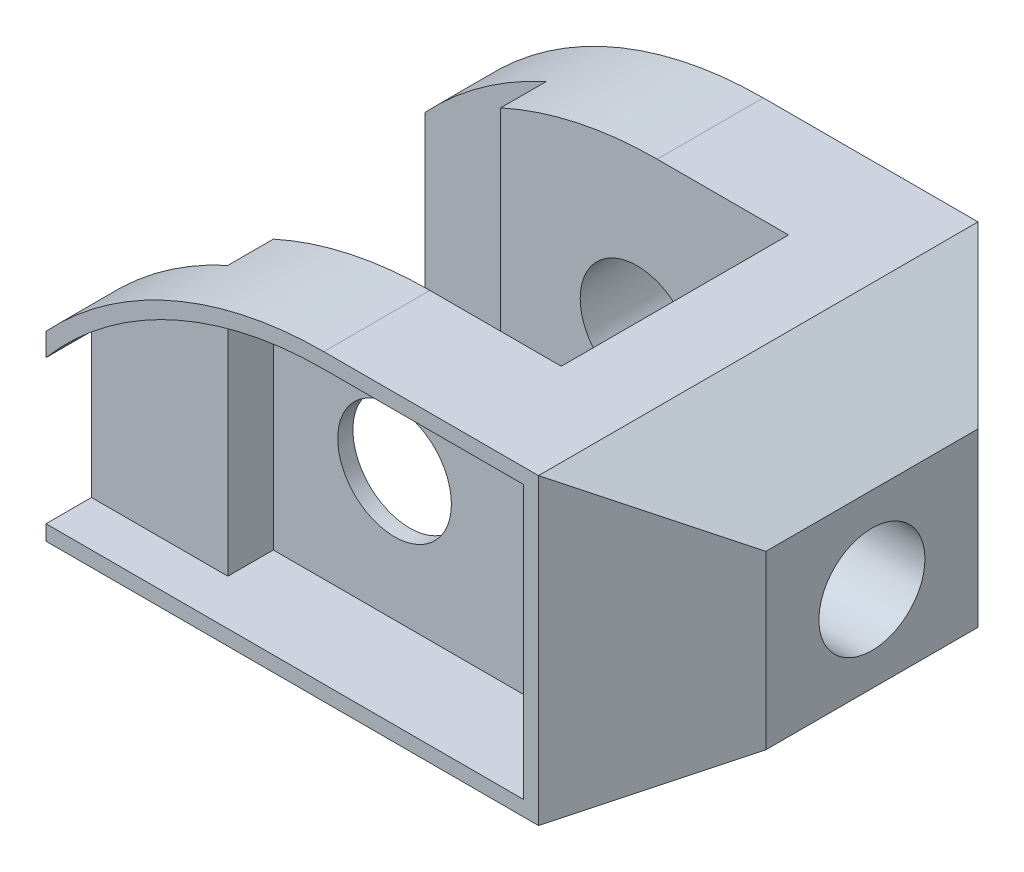
ISO-10303-21;
HEADER;
FILE_DESCRIPTION(('STEP AP214'),'2;1');
FILE_NAME('part.step','',(''),(''),'','','');
FILE_SCHEMA(('AUTOMOTIVE_DESIGN { 1 0 10303 214 1 1 1 1 }'));
ENDSEC;
DATA;
#1=APPLICATION_CONTEXT('core data for automotive mechanical design processes');
#2=APPLICATION_PROTOCOL_DEFINITION('international standard','automotive_design',2000,#1);
#3=PRODUCT_CONTEXT('',#1,'mechanical');
#4=PRODUCT('Part','Part','',(#3));
#5=PRODUCT_RELATED_PRODUCT_CATEGORY('part','',(#4));
#6=PRODUCT_DEFINITION_FORMATION('','',#4);
#7=PRODUCT_DEFINITION_CONTEXT('part definition',#1,'design');
#8=PRODUCT_DEFINITION('design','',#6,#7);
#9=PRODUCT_DEFINITION_SHAPE('','',#8);
#10=(LENGTH_UNIT() NAMED_UNIT(*) SI_UNIT(.MILLI.,.METRE.));
#11=(NAMED_UNIT(*) PLANE_ANGLE_UNIT() SI_UNIT($,.RADIAN.));
#12=(NAMED_UNIT(*) SI_UNIT($,.STERADIAN.) SOLID_ANGLE_UNIT());
#13=UNCERTAINTY_MEASURE_WITH_UNIT(LENGTH_MEASURE(1.E-05),#10,'distance_accuracy_value','');
#14=(GEOMETRIC_REPRESENTATION_CONTEXT(3) GLOBAL_UNCERTAINTY_ASSIGNED_CONTEXT((#13)) GLOBAL_UNIT_ASSIGNED_CONTEXT((#10,
#11,#12)) REPRESENTATION_CONTEXT('',''));
#15=CARTESIAN_POINT('',(0.,0.,0.));
#16=DIRECTION('',(0.,0.,1.));
#17=DIRECTION('',(1.,0.,0.));
#18=AXIS2_PLACEMENT_3D('',#15,#16,#17);
#19=CARTESIAN_POINT('',(0.,0.,58.));
#20=DIRECTION('',(0.,0.,-1.));
#21=DIRECTION('',(-1.,0.,0.));
#22=AXIS2_PLACEMENT_3D('',#19,#20,#21);
#23=CYLINDRICAL_SURFACE('',#22,7.5);
#24=CARTESIAN_POINT('',(0.,0.,44.));
#25=DIRECTION('',(0.,0.,1.));
#26=DIRECTION('',(1.,0.,0.));
#27=AXIS2_PLACEMENT_3D('',#24,#25,#26);
#28=CIRCLE('',#27,7.5);
#29=CARTESIAN_POINT('',(7.5,0.,44.));
#30=VERTEX_POINT('',#29);
#31=EDGE_CURVE('E280',#30,#30,#28,.F.);
#32=ORIENTED_EDGE('',*,*,#31,.T.);
#33=EDGE_LOOP('',(#32));
#34=FACE_BOUND('',#33,.T.);
#35=CARTESIAN_POINT('',(0.,0.,46.));
#36=DIRECTION('',(0.,0.,1.));
#37=DIRECTION('',(1.,0.,0.));
#38=AXIS2_PLACEMENT_3D('',#35,#36,#37);
#39=CIRCLE('',#38,7.5);
#40=CARTESIAN_POINT('',(7.5,0.,46.));
#41=VERTEX_POINT('',#40);
#42=EDGE_CURVE('E219',#41,#41,#39,.F.);
#43=ORIENTED_EDGE('',*,*,#42,.F.);
#44=EDGE_LOOP('',(#43));
#45=FACE_BOUND('',#44,.T.);
#46=ADVANCED_FACE('F37',(#34,#45),#23,.F.);
#47=CARTESIAN_POINT('',(-34.,-19.,58.));
#48=DIRECTION('',(1.,0.,0.));
#49=DIRECTION('',(0.,0.,-1.));
#50=AXIS2_PLACEMENT_3D('',#47,#48,#49);
#51=PLANE('',#50);
#52=DIRECTION('',(0.,-1.,0.));
#53=VECTOR('',#52,1.);
#54=CARTESIAN_POINT('',(-34.,-19.,58.));
#55=LINE('',#54,#53);
#56=CARTESIAN_POINT('',(-34.,-17.,58.));
#57=VERTEX_POINT('',#56);
#58=CARTESIAN_POINT('',(-34.,-19.,58.));
#59=VERTEX_POINT('',#58);
#60=EDGE_CURVE('E340',#57,#59,#55,.T.);
#61=ORIENTED_EDGE('',*,*,#60,.F.);
#62=DIRECTION('',(0.,0.,1.));
#63=VECTOR('',#62,1.);
#64=CARTESIAN_POINT('',(-34.,-17.,52.));
#65=LINE('',#64,#63);
#66=CARTESIAN_POINT('',(-34.,-17.,52.));
#67=VERTEX_POINT('',#66);
#68=EDGE_CURVE('E256',#67,#57,#65,.T.);
#69=ORIENTED_EDGE('',*,*,#68,.F.);
#70=DIRECTION('',(0.,-1.,0.));
#71=VECTOR('',#70,1.);
#72=CARTESIAN_POINT('',(-34.,0.,52.));
#73=LINE('',#72,#71);
#74=CARTESIAN_POINT('',(-34.,1.98386676965933,52.));
#75=VERTEX_POINT('',#74);
#76=EDGE_CURVE('E248',#75,#67,#73,.T.);
#77=ORIENTED_EDGE('',*,*,#76,.F.);
#78=DIRECTION('',(0.,0.,1.));
#79=VECTOR('',#78,1.);
#80=CARTESIAN_POINT('',(-34.,1.98386676965933,52.));
#81=LINE('',#80,#79);
#82=CARTESIAN_POINT('',(-34.,1.98386676965933,58.));
#83=VERTEX_POINT('',#82);
#84=EDGE_CURVE('E253',#75,#83,#81,.T.);
#85=ORIENTED_EDGE('',*,*,#84,.T.);
#86=CARTESIAN_POINT('',(-34.,4.99999999999999,58.));
#87=VERTEX_POINT('',#86);
#88=EDGE_CURVE('E336',#87,#83,#55,.T.);
#89=ORIENTED_EDGE('',*,*,#88,.F.);
#90=DIRECTION('',(0.,0.,-1.));
#91=VECTOR('',#90,1.);
#92=CARTESIAN_POINT('',(-34.,4.99999999999999,58.));
#93=LINE('',#92,#91);
#94=CARTESIAN_POINT('',(-34.,5.,50.));
#95=VERTEX_POINT('',#94);
#96=EDGE_CURVE('E359',#87,#95,#93,.T.);
#97=ORIENTED_EDGE('',*,*,#96,.T.);
#98=DIRECTION('',(0.,-1.,0.));
#99=VECTOR('',#98,1.);
#100=CARTESIAN_POINT('',(-34.,21.001,50.));
#101=LINE('',#100,#99);
#102=CARTESIAN_POINT('',(-34.,-19.,50.));
#103=VERTEX_POINT('',#102);
#104=EDGE_CURVE('E310',#95,#103,#101,.T.);
#105=ORIENTED_EDGE('',*,*,#104,.T.);
#106=DIRECTION('',(0.,0.,-1.));
#107=VECTOR('',#106,1.);
#108=CARTESIAN_POINT('',(-34.,-19.,58.));
#109=LINE('',#108,#107);
#110=EDGE_CURVE('E377',#59,#103,#109,.T.);
#111=ORIENTED_EDGE('',*,*,#110,.F.);
#112=EDGE_LOOP('',(#61,#69,#77,#85,#89,#97,#105,#111));
#113=FACE_BOUND('',#112,.T.);
#114=ADVANCED_FACE('F452',(#113),#51,.F.);
#115=CARTESIAN_POINT('',(2.66060555964672,-29.,58.));
#116=DIRECTION('',(0.,0.,-1.));
#117=DIRECTION('',(-1.,0.,0.));
#118=AXIS2_PLACEMENT_3D('',#115,#116,#117);
#119=CYLINDRICAL_SURFACE('',#118,50.);
#120=DIRECTION('',(0.,0.,-1.));
#121=VECTOR('',#120,1.);
#122=CARTESIAN_POINT('',(-18.,16.5317403347236,58.));
#123=LINE('',#122,#121);
#124=CARTESIAN_POINT('',(-18.,16.5317403347236,50.));
#125=VERTEX_POINT('',#124);
#126=CARTESIAN_POINT('',(-18.,16.5317403347236,44.));
#127=VERTEX_POINT('',#126);
#128=EDGE_CURVE('E273',#125,#127,#123,.T.);
#129=ORIENTED_EDGE('',*,*,#128,.F.);
#130=CARTESIAN_POINT('',(2.66060555964672,-29.,50.));
#131=DIRECTION('',(0.,0.,1.));
#132=DIRECTION('',(1.,0.,0.));
#133=AXIS2_PLACEMENT_3D('',#130,#131,#132);
#134=CIRCLE('',#133,50.);
#135=EDGE_CURVE('E276',#95,#125,#134,.F.);
#136=ORIENTED_EDGE('',*,*,#135,.F.);
#137=ORIENTED_EDGE('',*,*,#96,.F.);
#138=CARTESIAN_POINT('',(2.66060555964672,-29.,58.));
#139=DIRECTION('',(0.,0.,1.));
#140=DIRECTION('',(1.,0.,0.));
#141=AXIS2_PLACEMENT_3D('',#138,#139,#140);
#142=CIRCLE('',#141,50.);
#143=CARTESIAN_POINT('',(2.66060555964671,21.,58.));
#144=VERTEX_POINT('',#143);
#145=EDGE_CURVE('E345',#144,#87,#142,.T.);
#146=ORIENTED_EDGE('',*,*,#145,.F.);
#147=DIRECTION('',(0.,0.,-1.));
#148=VECTOR('',#147,1.);
#149=CARTESIAN_POINT('',(2.66060555964671,21.,58.));
#150=LINE('',#149,#148);
#151=CARTESIAN_POINT('',(2.66060555964671,21.,44.));
#152=VERTEX_POINT('',#151);
#153=EDGE_CURVE('E363',#144,#152,#150,.T.);
#154=ORIENTED_EDGE('',*,*,#153,.T.);
#155=CARTESIAN_POINT('',(2.66060555964672,-29.,44.));
#156=DIRECTION('',(0.,0.,1.));
#157=DIRECTION('',(1.,0.,0.));
#158=AXIS2_PLACEMENT_3D('',#155,#156,#157);
#159=CIRCLE('',#158,50.);
#160=EDGE_CURVE('E271',#127,#152,#159,.F.);
#161=ORIENTED_EDGE('',*,*,#160,.F.);
#162=EDGE_LOOP('',(#129,#136,#137,#146,#154,#161));
#163=FACE_BOUND('',#162,.T.);
#164=ADVANCED_FACE('F447',(#163),#119,.T.);
#165=CARTESIAN_POINT('',(2.66060555964672,-29.,58.));
#166=DIRECTION('',(0.,0.,1.));
#167=DIRECTION('',(1.,0.,0.));
#168=AXIS2_PLACEMENT_3D('',#165,#166,#167);
#169=PLANE('',#168);
#170=DIRECTION('',(0.,1.,0.));
#171=VECTOR('',#170,1.);
#172=CARTESIAN_POINT('',(29.,0.,58.));
#173=LINE('',#172,#171);
#174=CARTESIAN_POINT('',(29.,-17.,58.));
#175=VERTEX_POINT('',#174);
#176=CARTESIAN_POINT('',(29.,19.,58.));
#177=VERTEX_POINT('',#176);
#178=EDGE_CURVE('E222',#175,#177,#173,.T.);
#179=ORIENTED_EDGE('',*,*,#178,.F.);
#180=DIRECTION('',(1.,0.,0.));
#181=VECTOR('',#180,1.);
#182=CARTESIAN_POINT('',(0.,-17.,58.));
#183=LINE('',#182,#181);
#184=EDGE_CURVE('E245',#57,#175,#183,.T.);
#185=ORIENTED_EDGE('',*,*,#184,.F.);
#186=ORIENTED_EDGE('',*,*,#60,.T.);
#187=DIRECTION('',(1.,0.,0.));
#188=VECTOR('',#187,1.);
#189=CARTESIAN_POINT('',(-34.,-19.,58.));
#190=LINE('',#189,#188);
#191=CARTESIAN_POINT('',(31.,-19.,58.));
#192=VERTEX_POINT('',#191);
#193=EDGE_CURVE('E339',#59,#192,#190,.T.);
#194=ORIENTED_EDGE('',*,*,#193,.T.);
#195=DIRECTION('',(0.,1.,0.));
#196=VECTOR('',#195,1.);
#197=CARTESIAN_POINT('',(31.,12.3397459621556,58.));
#198=LINE('',#197,#196);
#199=CARTESIAN_POINT('',(31.,21.,58.));
#200=VERTEX_POINT('',#199);
#201=EDGE_CURVE('E11',#192,#200,#198,.T.);
#202=ORIENTED_EDGE('',*,*,#201,.T.);
#203=DIRECTION('',(-1.,0.,0.));
#204=VECTOR('',#203,1.);
#205=CARTESIAN_POINT('',(31.,21.,58.));
#206=LINE('',#205,#204);
#207=EDGE_CURVE('E343',#200,#144,#206,.T.);
#208=ORIENTED_EDGE('',*,*,#207,.T.);
#209=ORIENTED_EDGE('',*,*,#145,.T.);
#210=ORIENTED_EDGE('',*,*,#88,.T.);
#211=CARTESIAN_POINT('',(2.66060555964672,-29.,58.));
#212=DIRECTION('',(0.,0.,1.));
#213=DIRECTION('',(1.,0.,0.));
#214=AXIS2_PLACEMENT_3D('',#211,#212,#213);
#215=CIRCLE('',#214,48.);
#216=CARTESIAN_POINT('',(2.66060555964671,19.,58.));
#217=VERTEX_POINT('',#216);
#218=EDGE_CURVE('E234',#217,#83,#215,.T.);
#219=ORIENTED_EDGE('',*,*,#218,.F.);
#220=DIRECTION('',(-1.,0.,0.));
#221=VECTOR('',#220,1.);
#222=CARTESIAN_POINT('',(0.,19.,58.));
#223=LINE('',#222,#221);
#224=EDGE_CURVE('E202',#177,#217,#223,.T.);
#225=ORIENTED_EDGE('',*,*,#224,.F.);
#226=EDGE_LOOP('',(#179,#185,#186,#194,#202,#208,#209,#210,#219,#225));
#227=FACE_BOUND('',#226,.T.);
#228=ADVANCED_FACE('F399',(#227),#169,.T.);
#229=CARTESIAN_POINT('',(2.66060555964672,-29.,0.));
#230=DIRECTION('',(0.,0.,1.));
#231=DIRECTION('',(1.,0.,0.));
#232=AXIS2_PLACEMENT_3D('',#229,#230,#231);
#233=PLANE('',#232);
#234=DIRECTION('',(-1.,0.,0.));
#235=VECTOR('',#234,1.);
#236=CARTESIAN_POINT('',(31.,21.,0.));
#237=LINE('',#236,#235);
#238=CARTESIAN_POINT('',(31.,21.,0.));
#239=VERTEX_POINT('',#238);
#240=CARTESIAN_POINT('',(2.66060555964671,21.,0.));
#241=VERTEX_POINT('',#240);
#242=EDGE_CURVE('E353',#239,#241,#237,.T.);
#243=ORIENTED_EDGE('',*,*,#242,.F.);
#244=DIRECTION('',(0.,-1.,0.));
#245=VECTOR('',#244,1.);
#246=CARTESIAN_POINT('',(30.9999999999999,-29.,0.));
#247=LINE('',#246,#245);
#248=CARTESIAN_POINT('',(31.,-19.,0.));
#249=VERTEX_POINT('',#248);
#250=EDGE_CURVE('E388',#239,#249,#247,.T.);
#251=ORIENTED_EDGE('',*,*,#250,.T.);
#252=DIRECTION('',(1.,0.,0.));
#253=VECTOR('',#252,1.);
#254=CARTESIAN_POINT('',(-34.,-19.,0.));
#255=LINE('',#254,#253);
#256=CARTESIAN_POINT('',(-34.,-19.,0.));
#257=VERTEX_POINT('',#256);
#258=EDGE_CURVE('E350',#257,#249,#255,.T.);
#259=ORIENTED_EDGE('',*,*,#258,.F.);
#260=DIRECTION('',(0.,-1.,0.));
#261=VECTOR('',#260,1.);
#262=CARTESIAN_POINT('',(-34.,-19.,0.));
#263=LINE('',#262,#261);
#264=CARTESIAN_POINT('',(-34.,4.99999999999999,0.));
#265=VERTEX_POINT('',#264);
#266=EDGE_CURVE('E335',#265,#257,#263,.T.);
#267=ORIENTED_EDGE('',*,*,#266,.F.);
#268=CARTESIAN_POINT('',(2.66060555964672,-29.,0.));
#269=DIRECTION('',(0.,0.,1.));
#270=DIRECTION('',(1.,0.,0.));
#271=AXIS2_PLACEMENT_3D('',#268,#269,#270);
#272=CIRCLE('',#271,50.);
#273=EDGE_CURVE('E356',#241,#265,#272,.T.);
#274=ORIENTED_EDGE('',*,*,#273,.F.);
#275=EDGE_LOOP('',(#243,#251,#259,#267,#274));
#276=FACE_BOUND('',#275,.T.);
#277=CARTESIAN_POINT('',(0.,0.,0.));
#278=DIRECTION('',(0.,0.,1.));
#279=DIRECTION('',(1.,0.,0.));
#280=AXIS2_PLACEMENT_3D('',#277,#278,#279);
#281=CIRCLE('',#280,7.5);
#282=CARTESIAN_POINT('',(7.5,0.,0.));
#283=VERTEX_POINT('',#282);
#284=EDGE_CURVE('E332',#283,#283,#281,.T.);
#285=ORIENTED_EDGE('',*,*,#284,.T.);
#286=EDGE_LOOP('',(#285));
#287=FACE_BOUND('',#286,.T.);
#288=ADVANCED_FACE('F423',(#276,#287),#233,.F.);
#289=CARTESIAN_POINT('',(-34.,-19.,8.));
#290=VERTEX_POINT('',#289);
#291=EDGE_CURVE('E376',#290,#257,#109,.T.);
#292=ORIENTED_EDGE('',*,*,#291,.F.);
#293=DIRECTION('',(0.,-1.,0.));
#294=VECTOR('',#293,1.);
#295=CARTESIAN_POINT('',(-34.,21.001,8.));
#296=LINE('',#295,#294);
#297=CARTESIAN_POINT('',(-34.,4.99999999999999,8.00000000000001));
#298=VERTEX_POINT('',#297);
#299=EDGE_CURVE('E309',#298,#290,#296,.T.);
#300=ORIENTED_EDGE('',*,*,#299,.F.);
#301=EDGE_CURVE('E347',#298,#265,#93,.T.);
#302=ORIENTED_EDGE('',*,*,#301,.T.);
#303=ORIENTED_EDGE('',*,*,#266,.T.);
#304=EDGE_LOOP('',(#292,#300,#302,#303));
#305=FACE_BOUND('',#304,.T.);
#306=ADVANCED_FACE('F482',(#305),#51,.F.);
#307=CARTESIAN_POINT('',(-34.,-19.,58.));
#308=DIRECTION('',(0.,1.,0.));
#309=DIRECTION('',(0.,0.,1.));
#310=AXIS2_PLACEMENT_3D('',#307,#308,#309);
#311=PLANE('',#310);
#312=ORIENTED_EDGE('',*,*,#110,.T.);
#313=DIRECTION('',(-1.,0.,0.));
#314=VECTOR('',#313,1.);
#315=CARTESIAN_POINT('',(-34.,-19.,50.));
#316=LINE('',#315,#314);
#317=CARTESIAN_POINT('',(-18.,-19.,50.));
#318=VERTEX_POINT('',#317);
#319=EDGE_CURVE('E307',#318,#103,#316,.T.);
#320=ORIENTED_EDGE('',*,*,#319,.F.);
#321=DIRECTION('',(0.,0.,1.));
#322=VECTOR('',#321,1.);
#323=CARTESIAN_POINT('',(-18.,-19.,50.));
#324=LINE('',#323,#322);
#325=CARTESIAN_POINT('',(-18.,-19.,44.));
#326=VERTEX_POINT('',#325);
#327=EDGE_CURVE('E304',#326,#318,#324,.T.);
#328=ORIENTED_EDGE('',*,*,#327,.F.);
#329=DIRECTION('',(-1.,0.,0.));
#330=VECTOR('',#329,1.);
#331=CARTESIAN_POINT('',(-18.,-19.,44.));
#332=LINE('',#331,#330);
#333=CARTESIAN_POINT('',(20.,-19.,44.));
#334=VERTEX_POINT('',#333);
#335=EDGE_CURVE('E301',#334,#326,#332,.T.);
#336=ORIENTED_EDGE('',*,*,#335,.F.);
#337=DIRECTION('',(0.,0.,1.));
#338=VECTOR('',#337,1.);
#339=CARTESIAN_POINT('',(20.,-19.,44.));
#340=LINE('',#339,#338);
#341=CARTESIAN_POINT('',(20.,-19.,14.));
#342=VERTEX_POINT('',#341);
#343=EDGE_CURVE('E298',#342,#334,#340,.T.);
#344=ORIENTED_EDGE('',*,*,#343,.F.);
#345=DIRECTION('',(1.,0.,0.));
#346=VECTOR('',#345,1.);
#347=CARTESIAN_POINT('',(20.,-19.,14.));
#348=LINE('',#347,#346);
#349=CARTESIAN_POINT('',(-18.,-19.,14.));
#350=VERTEX_POINT('',#349);
#351=EDGE_CURVE('E295',#350,#342,#348,.T.);
#352=ORIENTED_EDGE('',*,*,#351,.F.);
#353=DIRECTION('',(0.,0.,1.));
#354=VECTOR('',#353,1.);
#355=CARTESIAN_POINT('',(-18.,-19.,14.));
#356=LINE('',#355,#354);
#357=CARTESIAN_POINT('',(-18.,-19.,8.));
#358=VERTEX_POINT('',#357);
#359=EDGE_CURVE('E292',#358,#350,#356,.T.);
#360=ORIENTED_EDGE('',*,*,#359,.F.);
#361=DIRECTION('',(1.,0.,0.));
#362=VECTOR('',#361,1.);
#363=CARTESIAN_POINT('',(-18.,-19.,8.));
#364=LINE('',#363,#362);
#365=EDGE_CURVE('E289',#290,#358,#364,.T.);
#366=ORIENTED_EDGE('',*,*,#365,.F.);
#367=ORIENTED_EDGE('',*,*,#291,.T.);
#368=ORIENTED_EDGE('',*,*,#258,.T.);
#369=DIRECTION('',(0.,0.,-1.));
#370=VECTOR('',#369,1.);
#371=CARTESIAN_POINT('',(31.,-19.,58.));
#372=LINE('',#371,#370);
#373=EDGE_CURVE('E374',#192,#249,#372,.T.);
#374=ORIENTED_EDGE('',*,*,#373,.F.);
#375=ORIENTED_EDGE('',*,*,#193,.F.);
#376=EDGE_LOOP('',(#312,#320,#328,#336,#344,#352,#360,#366,#367,#368,#374,#375));
#377=FACE_BOUND('',#376,.T.);
#378=ADVANCED_FACE('F405',(#377),#311,.F.);
#379=CARTESIAN_POINT('',(31.,-19.,58.));
#380=DIRECTION('',(-0.500000000000001,0.866025403784438,0.));
#381=DIRECTION('',(-0.866025403784438,-0.500000000000001,0.));
#382=AXIS2_PLACEMENT_3D('',#379,#380,#381);
#383=PLANE('',#382);
#384=ORIENTED_EDGE('',*,*,#373,.T.);
#385=DIRECTION('',(-0.654653670707977,-0.377964473009229,-0.654653670707976));
#386=VECTOR('',#385,1.);
#387=CARTESIAN_POINT('',(46.,-10.3397459621556,15.));
#388=LINE('',#387,#386);
#389=CARTESIAN_POINT('',(46.,-10.3397459621556,15.));
#390=VERTEX_POINT('',#389);
#391=EDGE_CURVE('E46',#249,#390,#388,.F.);
#392=ORIENTED_EDGE('',*,*,#391,.T.);
#393=DIRECTION('',(0.,0.,-1.));
#394=VECTOR('',#393,1.);
#395=CARTESIAN_POINT('',(46.,-10.3397459621556,58.));
#396=LINE('',#395,#394);
#397=CARTESIAN_POINT('',(46.,-10.3397459621556,42.9999999999999));
#398=VERTEX_POINT('',#397);
#399=EDGE_CURVE('E372',#398,#390,#396,.T.);
#400=ORIENTED_EDGE('',*,*,#399,.F.);
#401=DIRECTION('',(-0.654653670707976,-0.377964473009228,0.654653670707978));
#402=VECTOR('',#401,1.);
#403=CARTESIAN_POINT('',(28.525641703473,-20.4285714285714,60.474358296527));
#404=LINE('',#403,#402);
#405=EDGE_CURVE('E390',#398,#192,#404,.T.);
#406=ORIENTED_EDGE('',*,*,#405,.T.);
#407=EDGE_LOOP('',(#384,#392,#400,#406));
#408=FACE_BOUND('',#407,.T.);
#409=ADVANCED_FACE('F392',(#408),#383,.F.);
#410=CARTESIAN_POINT('',(46.,-10.3397459621556,58.));
#411=DIRECTION('',(-1.,0.,0.));
#412=DIRECTION('',(0.,0.,1.));
#413=AXIS2_PLACEMENT_3D('',#410,#411,#412);
#414=PLANE('',#413);
#415=CARTESIAN_POINT('',(46.,1.,29.));
#416=DIRECTION('',(1.,0.,0.));
#417=DIRECTION('',(0.,0.,-1.));
#418=AXIS2_PLACEMENT_3D('',#415,#416,#417);
#419=CIRCLE('',#418,7.);
#420=CARTESIAN_POINT('',(46.,1.,22.));
#421=VERTEX_POINT('',#420);
#422=EDGE_CURVE('E258',#421,#421,#419,.T.);
#423=ORIENTED_EDGE('',*,*,#422,.F.);
#424=EDGE_LOOP('',(#423));
#425=FACE_BOUND('',#424,.T.);
#426=ORIENTED_EDGE('',*,*,#399,.T.);
#427=DIRECTION('',(0.,1.,0.));
#428=VECTOR('',#427,1.);
#429=CARTESIAN_POINT('',(46.,-10.3397459621556,15.));
#430=LINE('',#429,#428);
#431=CARTESIAN_POINT('',(46.,12.3397459621556,15.));
#432=VERTEX_POINT('',#431);
#433=EDGE_CURVE('E381',#390,#432,#430,.T.);
#434=ORIENTED_EDGE('',*,*,#433,.T.);
#435=DIRECTION('',(0.,0.,-1.));
#436=VECTOR('',#435,1.);
#437=CARTESIAN_POINT('',(46.,12.3397459621556,58.));
#438=LINE('',#437,#436);
#439=CARTESIAN_POINT('',(46.,12.3397459621556,42.9999999999999));
#440=VERTEX_POINT('',#439);
#441=EDGE_CURVE('E369',#440,#432,#438,.T.);
#442=ORIENTED_EDGE('',*,*,#441,.F.);
#443=DIRECTION('',(0.,-1.,0.));
#444=VECTOR('',#443,1.);
#445=CARTESIAN_POINT('',(46.,-10.3397459621556,42.9999999999999));
#446=LINE('',#445,#444);
#447=EDGE_CURVE('E59',#440,#398,#446,.T.);
#448=ORIENTED_EDGE('',*,*,#447,.T.);
#449=EDGE_LOOP('',(#426,#434,#442,#448));
#450=FACE_BOUND('',#449,.T.);
#451=ADVANCED_FACE('F410',(#425,#450),#414,.F.);
#452=CARTESIAN_POINT('',(46.,12.3397459621556,58.));
#453=DIRECTION('',(-0.5,-0.866025403784438,0.));
#454=DIRECTION('',(0.866025403784439,-0.5,0.));
#455=AXIS2_PLACEMENT_3D('',#452,#453,#454);
#456=PLANE('',#455);
#457=ORIENTED_EDGE('',*,*,#441,.T.);
#458=DIRECTION('',(0.654653670707978,-0.377964473009228,0.654653670707976));
#459=VECTOR('',#458,1.);
#460=CARTESIAN_POINT('',(51.6117189003936,9.09981854439685,20.6117189003936));
#461=LINE('',#460,#459);
#462=EDGE_CURVE('E386',#432,#239,#461,.F.);
#463=ORIENTED_EDGE('',*,*,#462,.T.);
#464=DIRECTION('',(0.,0.,-1.));
#465=VECTOR('',#464,1.);
#466=CARTESIAN_POINT('',(31.,21.,58.));
#467=LINE('',#466,#465);
#468=EDGE_CURVE('E366',#200,#239,#467,.T.);
#469=ORIENTED_EDGE('',*,*,#468,.F.);
#470=DIRECTION('',(0.654653670707976,-0.377964473009227,-0.654653670707979));
#471=VECTOR('',#470,1.);
#472=CARTESIAN_POINT('',(43.3717914826348,13.8571428571429,45.6282085173651));
#473=LINE('',#472,#471);
#474=EDGE_CURVE('E384',#200,#440,#473,.T.);
#475=ORIENTED_EDGE('',*,*,#474,.T.);
#476=EDGE_LOOP('',(#457,#463,#469,#475));
#477=FACE_BOUND('',#476,.T.);
#478=ADVANCED_FACE('F408',(#477),#456,.F.);
#479=CARTESIAN_POINT('',(31.,21.,58.));
#480=DIRECTION('',(0.,-1.,0.));
#481=DIRECTION('',(1.,0.,0.));
#482=AXIS2_PLACEMENT_3D('',#479,#480,#481);
#483=PLANE('',#482);
#484=DIRECTION('',(0.,0.,-1.));
#485=VECTOR('',#484,1.);
#486=CARTESIAN_POINT('',(20.,21.,44.));
#487=LINE('',#486,#485);
#488=CARTESIAN_POINT('',(20.,21.,44.));
#489=VERTEX_POINT('',#488);
#490=CARTESIAN_POINT('',(20.,21.,14.));
#491=VERTEX_POINT('',#490);
#492=EDGE_CURVE('E283',#489,#491,#487,.T.);
#493=ORIENTED_EDGE('',*,*,#492,.F.);
#494=DIRECTION('',(1.,0.,0.));
#495=VECTOR('',#494,1.);
#496=CARTESIAN_POINT('',(-18.,21.,44.));
#497=LINE('',#496,#495);
#498=EDGE_CURVE('E286',#152,#489,#497,.T.);
#499=ORIENTED_EDGE('',*,*,#498,.F.);
#500=ORIENTED_EDGE('',*,*,#153,.F.);
#501=ORIENTED_EDGE('',*,*,#207,.F.);
#502=ORIENTED_EDGE('',*,*,#468,.T.);
#503=ORIENTED_EDGE('',*,*,#242,.T.);
#504=CARTESIAN_POINT('',(2.66060555964671,21.,14.));
#505=VERTEX_POINT('',#504);
#506=EDGE_CURVE('E362',#505,#241,#150,.T.);
#507=ORIENTED_EDGE('',*,*,#506,.F.);
#508=DIRECTION('',(-1.,0.,0.));
#509=VECTOR('',#508,1.);
#510=CARTESIAN_POINT('',(20.,21.,14.));
#511=LINE('',#510,#509);
#512=EDGE_CURVE('E328',#491,#505,#511,.T.);
#513=ORIENTED_EDGE('',*,*,#512,.F.);
#514=EDGE_LOOP('',(#493,#499,#500,#501,#502,#503,#507,#513));
#515=FACE_BOUND('',#514,.T.);
#516=ADVANCED_FACE('F418',(#515),#483,.F.);
#517=DIRECTION('',(0.,0.,-1.));
#518=VECTOR('',#517,1.);
#519=CARTESIAN_POINT('',(-17.9999999999999,16.5317403347236,58.));
#520=LINE('',#519,#518);
#521=CARTESIAN_POINT('',(-18.,16.5317403347236,14.));
#522=VERTEX_POINT('',#521);
#523=CARTESIAN_POINT('',(-18.,16.5317403347236,8.));
#524=VERTEX_POINT('',#523);
#525=EDGE_CURVE('E266',#522,#524,#520,.T.);
#526=ORIENTED_EDGE('',*,*,#525,.F.);
#527=CARTESIAN_POINT('',(2.66060555964672,-29.,14.));
#528=DIRECTION('',(0.,0.,-1.));
#529=DIRECTION('',(-1.,0.,0.));
#530=AXIS2_PLACEMENT_3D('',#527,#528,#529);
#531=CIRCLE('',#530,50.);
#532=EDGE_CURVE('E268',#505,#522,#531,.F.);
#533=ORIENTED_EDGE('',*,*,#532,.F.);
#534=ORIENTED_EDGE('',*,*,#506,.T.);
#535=ORIENTED_EDGE('',*,*,#273,.T.);
#536=ORIENTED_EDGE('',*,*,#301,.F.);
#537=CARTESIAN_POINT('',(2.66060555964672,-29.,8.));
#538=DIRECTION('',(0.,0.,-1.));
#539=DIRECTION('',(-1.,0.,0.));
#540=AXIS2_PLACEMENT_3D('',#537,#538,#539);
#541=CIRCLE('',#540,50.);
#542=EDGE_CURVE('E313',#524,#298,#541,.F.);
#543=ORIENTED_EDGE('',*,*,#542,.F.);
#544=EDGE_LOOP('',(#526,#533,#534,#535,#536,#543));
#545=FACE_BOUND('',#544,.T.);
#546=ADVANCED_FACE('F429',(#545),#119,.T.);
#547=CARTESIAN_POINT('',(0.,0.,14.));
#548=DIRECTION('',(0.,0.,-1.));
#549=DIRECTION('',(-1.,0.,0.));
#550=AXIS2_PLACEMENT_3D('',#547,#548,#549);
#551=CIRCLE('',#550,7.5);
#552=CARTESIAN_POINT('',(-7.5,0.,14.));
#553=VERTEX_POINT('',#552);
#554=EDGE_CURVE('E279',#553,#553,#551,.F.);
#555=ORIENTED_EDGE('',*,*,#554,.T.);
#556=EDGE_LOOP('',(#555));
#557=FACE_BOUND('',#556,.T.);
#558=ORIENTED_EDGE('',*,*,#284,.F.);
#559=EDGE_LOOP('',(#558));
#560=FACE_BOUND('',#559,.T.);
#561=ADVANCED_FACE('F495',(#557,#560),#23,.F.);
#562=CARTESIAN_POINT('',(-34.,21.001,50.));
#563=DIRECTION('',(0.,0.,1.));
#564=DIRECTION('',(1.,0.,0.));
#565=AXIS2_PLACEMENT_3D('',#562,#563,#564);
#566=PLANE('',#565);
#567=ORIENTED_EDGE('',*,*,#135,.T.);
#568=DIRECTION('',(0.,-1.,0.));
#569=VECTOR('',#568,1.);
#570=CARTESIAN_POINT('',(-18.,21.001,50.));
#571=LINE('',#570,#569);
#572=EDGE_CURVE('E314',#125,#318,#571,.T.);
#573=ORIENTED_EDGE('',*,*,#572,.T.);
#574=ORIENTED_EDGE('',*,*,#319,.T.);
#575=ORIENTED_EDGE('',*,*,#104,.F.);
#576=EDGE_LOOP('',(#567,#573,#574,#575));
#577=FACE_BOUND('',#576,.T.);
#578=ADVANCED_FACE('F469',(#577),#566,.F.);
#579=CARTESIAN_POINT('',(-18.,21.001,50.));
#580=DIRECTION('',(1.,0.,0.));
#581=DIRECTION('',(0.,0.,-1.));
#582=AXIS2_PLACEMENT_3D('',#579,#580,#581);
#583=PLANE('',#582);
#584=ORIENTED_EDGE('',*,*,#128,.T.);
#585=DIRECTION('',(0.,-1.,0.));
#586=VECTOR('',#585,1.);
#587=CARTESIAN_POINT('',(-18.,21.001,44.));
#588=LINE('',#587,#586);
#589=EDGE_CURVE('E316',#127,#326,#588,.T.);
#590=ORIENTED_EDGE('',*,*,#589,.T.);
#591=ORIENTED_EDGE('',*,*,#327,.T.);
#592=ORIENTED_EDGE('',*,*,#572,.F.);
#593=EDGE_LOOP('',(#584,#590,#591,#592));
#594=FACE_BOUND('',#593,.T.);
#595=ADVANCED_FACE('F471',(#594),#583,.F.);
#596=CARTESIAN_POINT('',(-18.,21.001,44.));
#597=DIRECTION('',(0.,0.,1.));
#598=DIRECTION('',(1.,0.,0.));
#599=AXIS2_PLACEMENT_3D('',#596,#597,#598);
#600=PLANE('',#599);
#601=ORIENTED_EDGE('',*,*,#31,.F.);
#602=EDGE_LOOP('',(#601));
#603=FACE_BOUND('',#602,.T.);
#604=ORIENTED_EDGE('',*,*,#498,.T.);
#605=DIRECTION('',(0.,-1.,0.));
#606=VECTOR('',#605,1.);
#607=CARTESIAN_POINT('',(20.,21.001,44.));
#608=LINE('',#607,#606);
#609=EDGE_CURVE('E318',#489,#334,#608,.T.);
#610=ORIENTED_EDGE('',*,*,#609,.T.);
#611=ORIENTED_EDGE('',*,*,#335,.T.);
#612=ORIENTED_EDGE('',*,*,#589,.F.);
#613=ORIENTED_EDGE('',*,*,#160,.T.);
#614=EDGE_LOOP('',(#604,#610,#611,#612,#613));
#615=FACE_BOUND('',#614,.T.);
#616=ADVANCED_FACE('F442',(#603,#615),#600,.F.);
#617=CARTESIAN_POINT('',(20.,21.001,44.));
#618=DIRECTION('',(1.,0.,0.));
#619=DIRECTION('',(0.,0.,-1.));
#620=AXIS2_PLACEMENT_3D('',#617,#618,#619);
#621=PLANE('',#620);
#622=CARTESIAN_POINT('',(20.,1.,29.));
#623=DIRECTION('',(1.,0.,0.));
#624=DIRECTION('',(0.,0.,-1.));
#625=AXIS2_PLACEMENT_3D('',#622,#623,#624);
#626=CIRCLE('',#625,7.);
#627=CARTESIAN_POINT('',(20.,1.,22.));
#628=VERTEX_POINT('',#627);
#629=EDGE_CURVE('E263',#628,#628,#626,.F.);
#630=ORIENTED_EDGE('',*,*,#629,.F.);
#631=EDGE_LOOP('',(#630));
#632=FACE_BOUND('',#631,.T.);
#633=ORIENTED_EDGE('',*,*,#492,.T.);
#634=DIRECTION('',(0.,-1.,0.));
#635=VECTOR('',#634,1.);
#636=CARTESIAN_POINT('',(20.,21.001,14.));
#637=LINE('',#636,#635);
#638=EDGE_CURVE('E320',#491,#342,#637,.T.);
#639=ORIENTED_EDGE('',*,*,#638,.T.);
#640=ORIENTED_EDGE('',*,*,#343,.T.);
#641=ORIENTED_EDGE('',*,*,#609,.F.);
#642=EDGE_LOOP('',(#633,#639,#640,#641));
#643=FACE_BOUND('',#642,.T.);
#644=ADVANCED_FACE('F439',(#632,#643),#621,.F.);
#645=CARTESIAN_POINT('',(20.,21.001,14.));
#646=DIRECTION('',(0.,0.,-1.));
#647=DIRECTION('',(-1.,0.,0.));
#648=AXIS2_PLACEMENT_3D('',#645,#646,#647);
#649=PLANE('',#648);
#650=ORIENTED_EDGE('',*,*,#554,.F.);
#651=EDGE_LOOP('',(#650));
#652=FACE_BOUND('',#651,.T.);
#653=ORIENTED_EDGE('',*,*,#512,.T.);
#654=ORIENTED_EDGE('',*,*,#532,.T.);
#655=DIRECTION('',(0.,-1.,0.));
#656=VECTOR('',#655,1.);
#657=CARTESIAN_POINT('',(-18.,21.001,14.));
#658=LINE('',#657,#656);
#659=EDGE_CURVE('E322',#522,#350,#658,.T.);
#660=ORIENTED_EDGE('',*,*,#659,.T.);
#661=ORIENTED_EDGE('',*,*,#351,.T.);
#662=ORIENTED_EDGE('',*,*,#638,.F.);
#663=EDGE_LOOP('',(#653,#654,#660,#661,#662));
#664=FACE_BOUND('',#663,.T.);
#665=ADVANCED_FACE('F435',(#652,#664),#649,.F.);
#666=CARTESIAN_POINT('',(-18.,21.001,14.));
#667=DIRECTION('',(1.,0.,0.));
#668=DIRECTION('',(0.,0.,-1.));
#669=AXIS2_PLACEMENT_3D('',#666,#667,#668);
#670=PLANE('',#669);
#671=ORIENTED_EDGE('',*,*,#525,.T.);
#672=DIRECTION('',(0.,-1.,0.));
#673=VECTOR('',#672,1.);
#674=CARTESIAN_POINT('',(-18.,21.001,8.));
#675=LINE('',#674,#673);
#676=EDGE_CURVE('E324',#524,#358,#675,.T.);
#677=ORIENTED_EDGE('',*,*,#676,.T.);
#678=ORIENTED_EDGE('',*,*,#359,.T.);
#679=ORIENTED_EDGE('',*,*,#659,.F.);
#680=EDGE_LOOP('',(#671,#677,#678,#679));
#681=FACE_BOUND('',#680,.T.);
#682=ADVANCED_FACE('F476',(#681),#670,.F.);
#683=CARTESIAN_POINT('',(-18.,21.001,8.));
#684=DIRECTION('',(0.,0.,-1.));
#685=DIRECTION('',(-1.,0.,0.));
#686=AXIS2_PLACEMENT_3D('',#683,#684,#685);
#687=PLANE('',#686);
#688=ORIENTED_EDGE('',*,*,#542,.T.);
#689=ORIENTED_EDGE('',*,*,#299,.T.);
#690=ORIENTED_EDGE('',*,*,#365,.T.);
#691=ORIENTED_EDGE('',*,*,#676,.F.);
#692=EDGE_LOOP('',(#688,#689,#690,#691));
#693=FACE_BOUND('',#692,.T.);
#694=ADVANCED_FACE('F479',(#693),#687,.F.);
#695=CARTESIAN_POINT('',(-34.001,1.,29.));
#696=DIRECTION('',(1.,0.,0.));
#697=DIRECTION('',(0.,0.,-1.));
#698=AXIS2_PLACEMENT_3D('',#695,#696,#697);
#699=CYLINDRICAL_SURFACE('',#698,7.);
#700=ORIENTED_EDGE('',*,*,#422,.T.);
#701=EDGE_LOOP('',(#700));
#702=FACE_BOUND('',#701,.T.);
#703=ORIENTED_EDGE('',*,*,#629,.T.);
#704=EDGE_LOOP('',(#703));
#705=FACE_BOUND('',#704,.T.);
#706=ADVANCED_FACE('F524',(#702,#705),#699,.F.);
#707=CARTESIAN_POINT('',(46.,-10.3397459621556,15.));
#708=DIRECTION('',(-0.707106781186547,0.,0.707106781186548));
#709=DIRECTION('',(0.,1.,0.));
#710=AXIS2_PLACEMENT_3D('',#707,#708,#709);
#711=PLANE('',#710);
#712=ORIENTED_EDGE('',*,*,#391,.F.);
#713=ORIENTED_EDGE('',*,*,#250,.F.);
#714=ORIENTED_EDGE('',*,*,#462,.F.);
#715=ORIENTED_EDGE('',*,*,#433,.F.);
#716=EDGE_LOOP('',(#712,#713,#714,#715));
#717=FACE_BOUND('',#716,.T.);
#718=ADVANCED_FACE('F413',(#717),#711,.F.);
#719=CARTESIAN_POINT('',(31.,-29.,58.));
#720=DIRECTION('',(0.707106781186549,0.,0.707106781186546));
#721=DIRECTION('',(0.,-1.,0.));
#722=AXIS2_PLACEMENT_3D('',#719,#720,#721);
#723=PLANE('',#722);
#724=ORIENTED_EDGE('',*,*,#405,.F.);
#725=ORIENTED_EDGE('',*,*,#447,.F.);
#726=ORIENTED_EDGE('',*,*,#474,.F.);
#727=ORIENTED_EDGE('',*,*,#201,.F.);
#728=EDGE_LOOP('',(#724,#725,#726,#727));
#729=FACE_BOUND('',#728,.T.);
#730=ADVANCED_FACE('F40',(#729),#723,.T.);
#731=CARTESIAN_POINT('',(0.,-17.,52.));
#732=DIRECTION('',(0.,-1.,0.));
#733=DIRECTION('',(0.,0.,-1.));
#734=AXIS2_PLACEMENT_3D('',#731,#732,#733);
#735=PLANE('',#734);
#736=ORIENTED_EDGE('',*,*,#184,.T.);
#737=DIRECTION('',(0.,0.,1.));
#738=VECTOR('',#737,1.);
#739=CARTESIAN_POINT('',(29.,-17.,46.));
#740=LINE('',#739,#738);
#741=CARTESIAN_POINT('',(29.,-17.,46.));
#742=VERTEX_POINT('',#741);
#743=EDGE_CURVE('E235',#742,#175,#740,.T.);
#744=ORIENTED_EDGE('',*,*,#743,.F.);
#745=DIRECTION('',(1.,0.,0.));
#746=VECTOR('',#745,1.);
#747=CARTESIAN_POINT('',(0.,-17.,46.));
#748=LINE('',#747,#746);
#749=CARTESIAN_POINT('',(-16.,-17.,46.));
#750=VERTEX_POINT('',#749);
#751=EDGE_CURVE('E226',#750,#742,#748,.T.);
#752=ORIENTED_EDGE('',*,*,#751,.F.);
#753=DIRECTION('',(0.,0.,1.));
#754=VECTOR('',#753,1.);
#755=CARTESIAN_POINT('',(-16.,-17.,46.));
#756=LINE('',#755,#754);
#757=CARTESIAN_POINT('',(-16.,-17.,52.));
#758=VERTEX_POINT('',#757);
#759=EDGE_CURVE('E238',#750,#758,#756,.T.);
#760=ORIENTED_EDGE('',*,*,#759,.T.);
#761=DIRECTION('',(1.,0.,0.));
#762=VECTOR('',#761,1.);
#763=CARTESIAN_POINT('',(0.,-17.,52.));
#764=LINE('',#763,#762);
#765=EDGE_CURVE('E250',#67,#758,#764,.T.);
#766=ORIENTED_EDGE('',*,*,#765,.F.);
#767=ORIENTED_EDGE('',*,*,#68,.T.);
#768=EDGE_LOOP('',(#736,#744,#752,#760,#766,#767));
#769=FACE_BOUND('',#768,.T.);
#770=ADVANCED_FACE('F463',(#769),#735,.F.);
#771=CARTESIAN_POINT('',(2.66060555964672,-29.,52.));
#772=DIRECTION('',(0.,0.,1.));
#773=DIRECTION('',(1.,0.,0.));
#774=AXIS2_PLACEMENT_3D('',#771,#772,#773);
#775=CYLINDRICAL_SURFACE('',#774,48.);
#776=ORIENTED_EDGE('',*,*,#218,.T.);
#777=ORIENTED_EDGE('',*,*,#84,.F.);
#778=CARTESIAN_POINT('',(2.66060555964672,-29.,52.));
#779=DIRECTION('',(0.,0.,1.));
#780=DIRECTION('',(1.,0.,0.));
#781=AXIS2_PLACEMENT_3D('',#778,#779,#780);
#782=CIRCLE('',#781,48.);
#783=CARTESIAN_POINT('',(-16.,15.2242218715862,52.));
#784=VERTEX_POINT('',#783);
#785=EDGE_CURVE('E244',#784,#75,#782,.T.);
#786=ORIENTED_EDGE('',*,*,#785,.F.);
#787=DIRECTION('',(0.,0.,1.));
#788=VECTOR('',#787,1.);
#789=CARTESIAN_POINT('',(-16.,15.2242218715862,46.));
#790=LINE('',#789,#788);
#791=CARTESIAN_POINT('',(-16.,15.2242218715862,46.));
#792=VERTEX_POINT('',#791);
#793=EDGE_CURVE('E204',#792,#784,#790,.T.);
#794=ORIENTED_EDGE('',*,*,#793,.F.);
#795=CARTESIAN_POINT('',(2.66060555964672,-29.,46.));
#796=DIRECTION('',(0.,0.,1.));
#797=DIRECTION('',(1.,0.,0.));
#798=AXIS2_PLACEMENT_3D('',#795,#796,#797);
#799=CIRCLE('',#798,48.);
#800=CARTESIAN_POINT('',(2.66060555964671,19.,46.));
#801=VERTEX_POINT('',#800);
#802=EDGE_CURVE('E208',#801,#792,#799,.T.);
#803=ORIENTED_EDGE('',*,*,#802,.F.);
#804=DIRECTION('',(0.,0.,1.));
#805=VECTOR('',#804,1.);
#806=CARTESIAN_POINT('',(2.66060555964671,19.,46.));
#807=LINE('',#806,#805);
#808=EDGE_CURVE('E195',#801,#217,#807,.T.);
#809=ORIENTED_EDGE('',*,*,#808,.T.);
#810=EDGE_LOOP('',(#776,#777,#786,#794,#803,#809));
#811=FACE_BOUND('',#810,.T.);
#812=ADVANCED_FACE('F209',(#811),#775,.F.);
#813=CARTESIAN_POINT('',(0.,0.,52.));
#814=DIRECTION('',(0.,0.,1.));
#815=DIRECTION('',(1.,0.,0.));
#816=AXIS2_PLACEMENT_3D('',#813,#814,#815);
#817=PLANE('',#816);
#818=DIRECTION('',(0.,-1.,0.));
#819=VECTOR('',#818,1.);
#820=CARTESIAN_POINT('',(-16.,0.,52.));
#821=LINE('',#820,#819);
#822=EDGE_CURVE('E242',#784,#758,#821,.T.);
#823=ORIENTED_EDGE('',*,*,#822,.F.);
#824=ORIENTED_EDGE('',*,*,#785,.T.);
#825=ORIENTED_EDGE('',*,*,#76,.T.);
#826=ORIENTED_EDGE('',*,*,#765,.T.);
#827=EDGE_LOOP('',(#823,#824,#825,#826));
#828=FACE_BOUND('',#827,.T.);
#829=ADVANCED_FACE('F457',(#828),#817,.T.);
#830=CARTESIAN_POINT('',(0.,19.,46.));
#831=DIRECTION('',(0.,1.,0.));
#832=DIRECTION('',(-1.,0.,0.));
#833=AXIS2_PLACEMENT_3D('',#830,#831,#832);
#834=PLANE('',#833);
#835=ORIENTED_EDGE('',*,*,#224,.T.);
#836=ORIENTED_EDGE('',*,*,#808,.F.);
#837=DIRECTION('',(-1.,0.,0.));
#838=VECTOR('',#837,1.);
#839=CARTESIAN_POINT('',(0.,19.,46.));
#840=LINE('',#839,#838);
#841=CARTESIAN_POINT('',(29.,19.,46.));
#842=VERTEX_POINT('',#841);
#843=EDGE_CURVE('E199',#842,#801,#840,.T.);
#844=ORIENTED_EDGE('',*,*,#843,.F.);
#845=DIRECTION('',(0.,0.,1.));
#846=VECTOR('',#845,1.);
#847=CARTESIAN_POINT('',(29.,19.,46.));
#848=LINE('',#847,#846);
#849=EDGE_CURVE('E232',#842,#177,#848,.T.);
#850=ORIENTED_EDGE('',*,*,#849,.T.);
#851=EDGE_LOOP('',(#835,#836,#844,#850));
#852=FACE_BOUND('',#851,.T.);
#853=ADVANCED_FACE('F197',(#852),#834,.F.);
#854=CARTESIAN_POINT('',(29.,0.,46.));
#855=DIRECTION('',(1.,0.,0.));
#856=DIRECTION('',(0.,1.,0.));
#857=AXIS2_PLACEMENT_3D('',#854,#855,#856);
#858=PLANE('',#857);
#859=ORIENTED_EDGE('',*,*,#178,.T.);
#860=ORIENTED_EDGE('',*,*,#849,.F.);
#861=DIRECTION('',(0.,1.,0.));
#862=VECTOR('',#861,1.);
#863=CARTESIAN_POINT('',(29.,0.,46.));
#864=LINE('',#863,#862);
#865=EDGE_CURVE('E205',#742,#842,#864,.T.);
#866=ORIENTED_EDGE('',*,*,#865,.F.);
#867=ORIENTED_EDGE('',*,*,#743,.T.);
#868=EDGE_LOOP('',(#859,#860,#866,#867));
#869=FACE_BOUND('',#868,.T.);
#870=ADVANCED_FACE('F465',(#869),#858,.F.);
#871=CARTESIAN_POINT('',(-16.,0.,46.));
#872=DIRECTION('',(-1.,0.,0.));
#873=DIRECTION('',(0.,-1.,0.));
#874=AXIS2_PLACEMENT_3D('',#871,#872,#873);
#875=PLANE('',#874);
#876=ORIENTED_EDGE('',*,*,#822,.T.);
#877=ORIENTED_EDGE('',*,*,#759,.F.);
#878=DIRECTION('',(0.,-1.,0.));
#879=VECTOR('',#878,1.);
#880=CARTESIAN_POINT('',(-16.,0.,46.));
#881=LINE('',#880,#879);
#882=EDGE_CURVE('E214',#792,#750,#881,.T.);
#883=ORIENTED_EDGE('',*,*,#882,.F.);
#884=ORIENTED_EDGE('',*,*,#793,.T.);
#885=EDGE_LOOP('',(#876,#877,#883,#884));
#886=FACE_BOUND('',#885,.T.);
#887=ADVANCED_FACE('F460',(#886),#875,.F.);
#888=CARTESIAN_POINT('',(0.,0.,46.));
#889=DIRECTION('',(0.,0.,1.));
#890=DIRECTION('',(1.,0.,0.));
#891=AXIS2_PLACEMENT_3D('',#888,#889,#890);
#892=PLANE('',#891);
#893=ORIENTED_EDGE('',*,*,#42,.T.);
#894=EDGE_LOOP('',(#893));
#895=FACE_BOUND('',#894,.T.);
#896=ORIENTED_EDGE('',*,*,#843,.T.);
#897=ORIENTED_EDGE('',*,*,#802,.T.);
#898=ORIENTED_EDGE('',*,*,#882,.T.);
#899=ORIENTED_EDGE('',*,*,#751,.T.);
#900=ORIENTED_EDGE('',*,*,#865,.T.);
#901=EDGE_LOOP('',(#896,#897,#898,#899,#900));
#902=FACE_BOUND('',#901,.T.);
#903=ADVANCED_FACE('F216',(#895,#902),#892,.T.);
#904=CLOSED_SHELL('',(#46,#114,#164,#228,#288,#306,#378,#409,#451,#478,#516,#546,#561,#578,#595,
#616,#644,#665,#682,#694,#706,#718,#730,#770,#812,#829,#853,#870,#887,#903));
#905=MANIFOLD_SOLID_BREP('B2',#904);
#906=ADVANCED_BREP_SHAPE_REPRESENTATION('',(#18,#905),#14);
#907=SHAPE_DEFINITION_REPRESENTATION(#9,#906);
ENDSEC;
END-ISO-10303-21;
